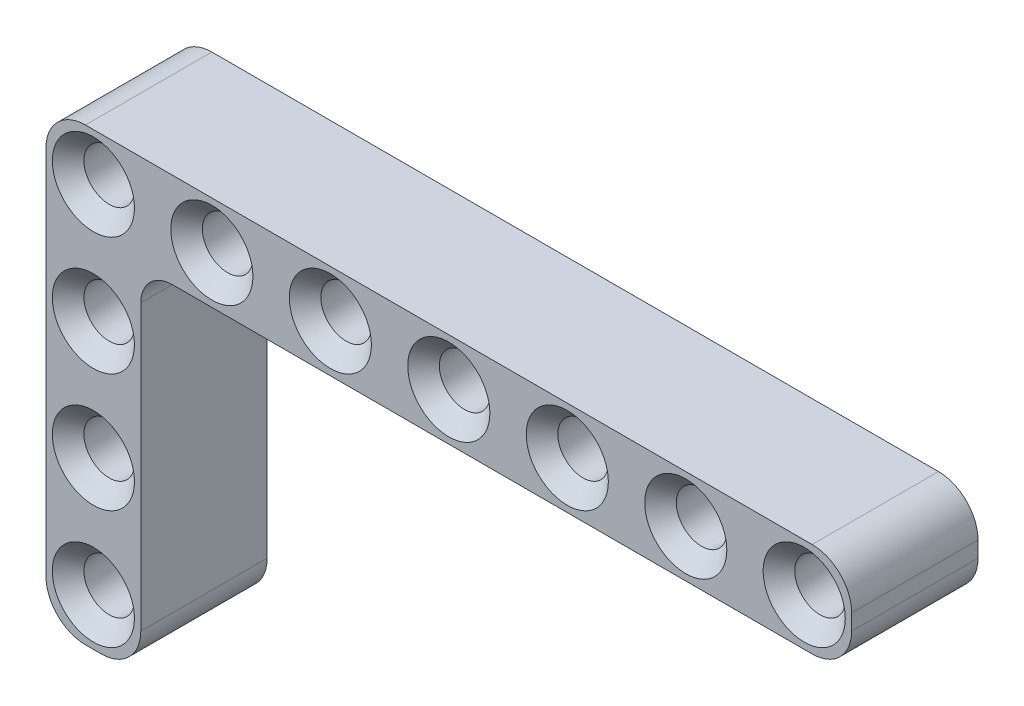
ISO-10303-21;
HEADER;
FILE_DESCRIPTION(('STEP AP214'),'2;1');
FILE_NAME('part.step','',(''),(''),'','','');
FILE_SCHEMA(('AUTOMOTIVE_DESIGN { 1 0 10303 214 1 1 1 1 }'));
ENDSEC;
DATA;
#1=APPLICATION_CONTEXT('core data for automotive mechanical design processes');
#2=APPLICATION_PROTOCOL_DEFINITION('international standard','automotive_design',2000,#1);
#3=PRODUCT_CONTEXT('',#1,'mechanical');
#4=PRODUCT('Part','Part','',(#3));
#5=PRODUCT_RELATED_PRODUCT_CATEGORY('part','',(#4));
#6=PRODUCT_DEFINITION_FORMATION('','',#4);
#7=PRODUCT_DEFINITION_CONTEXT('part definition',#1,'design');
#8=PRODUCT_DEFINITION('design','',#6,#7);
#9=PRODUCT_DEFINITION_SHAPE('','',#8);
#10=(LENGTH_UNIT() NAMED_UNIT(*) SI_UNIT(.MILLI.,.METRE.));
#11=(NAMED_UNIT(*) PLANE_ANGLE_UNIT() SI_UNIT($,.RADIAN.));
#12=(NAMED_UNIT(*) SI_UNIT($,.STERADIAN.) SOLID_ANGLE_UNIT());
#13=UNCERTAINTY_MEASURE_WITH_UNIT(LENGTH_MEASURE(1.E-05),#10,'distance_accuracy_value','');
#14=(GEOMETRIC_REPRESENTATION_CONTEXT(3) GLOBAL_UNCERTAINTY_ASSIGNED_CONTEXT((#13)) GLOBAL_UNIT_ASSIGNED_CONTEXT((#10,
#11,#12)) REPRESENTATION_CONTEXT('',''));
#15=CARTESIAN_POINT('',(0.,0.,0.));
#16=DIRECTION('',(0.,0.,1.));
#17=DIRECTION('',(1.,0.,0.));
#18=AXIS2_PLACEMENT_3D('',#15,#16,#17);
#19=CARTESIAN_POINT('',(45.5,-0.5,8.));
#20=DIRECTION('',(0.,0.,1.));
#21=DIRECTION('',(1.,0.,0.));
#22=AXIS2_PLACEMENT_3D('',#19,#20,#21);
#23=PLANE('',#22);
#24=CARTESIAN_POINT('',(0.,-7.5,8.));
#25=DIRECTION('',(0.,0.,1.));
#26=DIRECTION('',(1.,0.,0.));
#27=AXIS2_PLACEMENT_3D('',#24,#25,#26);
#28=CIRCLE('',#27,2.6);
#29=CARTESIAN_POINT('',(2.60000000000003,-7.5,8.));
#30=VERTEX_POINT('',#29);
#31=EDGE_CURVE('E318',#30,#30,#28,.F.);
#32=ORIENTED_EDGE('',*,*,#31,.T.);
#33=EDGE_LOOP('',(#32));
#34=FACE_BOUND('',#33,.T.);
#35=CARTESIAN_POINT('',(1.10050857315969E-13,-15.,8.));
#36=DIRECTION('',(0.,0.,1.));
#37=DIRECTION('',(1.,0.,0.));
#38=AXIS2_PLACEMENT_3D('',#35,#36,#37);
#39=CIRCLE('',#38,2.60000000000002);
#40=CARTESIAN_POINT('',(2.60000000000013,-15.,8.));
#41=VERTEX_POINT('',#40);
#42=EDGE_CURVE('E315',#41,#41,#39,.F.);
#43=ORIENTED_EDGE('',*,*,#42,.T.);
#44=EDGE_LOOP('',(#43));
#45=FACE_BOUND('',#44,.T.);
#46=CARTESIAN_POINT('',(1.88609187439939E-13,-22.5,8.));
#47=DIRECTION('',(0.,0.,1.));
#48=DIRECTION('',(1.,0.,0.));
#49=AXIS2_PLACEMENT_3D('',#46,#47,#48);
#50=CIRCLE('',#49,2.6);
#51=CARTESIAN_POINT('',(2.60000000000019,-22.5,8.));
#52=VERTEX_POINT('',#51);
#53=EDGE_CURVE('E312',#52,#52,#50,.F.);
#54=ORIENTED_EDGE('',*,*,#53,.T.);
#55=EDGE_LOOP('',(#54));
#56=FACE_BOUND('',#55,.T.);
#57=CARTESIAN_POINT('',(45.,0.,8.));
#58=DIRECTION('',(0.,0.,1.));
#59=DIRECTION('',(1.,0.,0.));
#60=AXIS2_PLACEMENT_3D('',#57,#58,#59);
#61=CIRCLE('',#60,2.60000000000001);
#62=CARTESIAN_POINT('',(47.6,0.,8.));
#63=VERTEX_POINT('',#62);
#64=EDGE_CURVE('E297',#63,#63,#61,.F.);
#65=ORIENTED_EDGE('',*,*,#64,.T.);
#66=EDGE_LOOP('',(#65));
#67=FACE_BOUND('',#66,.T.);
#68=CARTESIAN_POINT('',(37.5,0.,8.));
#69=DIRECTION('',(0.,0.,1.));
#70=DIRECTION('',(1.,0.,0.));
#71=AXIS2_PLACEMENT_3D('',#68,#69,#70);
#72=CIRCLE('',#71,2.60000000000001);
#73=CARTESIAN_POINT('',(40.1,0.,8.));
#74=VERTEX_POINT('',#73);
#75=EDGE_CURVE('E294',#74,#74,#72,.F.);
#76=ORIENTED_EDGE('',*,*,#75,.T.);
#77=EDGE_LOOP('',(#76));
#78=FACE_BOUND('',#77,.T.);
#79=CARTESIAN_POINT('',(30.,0.,8.));
#80=DIRECTION('',(0.,0.,1.));
#81=DIRECTION('',(1.,0.,0.));
#82=AXIS2_PLACEMENT_3D('',#79,#80,#81);
#83=CIRCLE('',#82,2.6);
#84=CARTESIAN_POINT('',(32.6,0.,8.));
#85=VERTEX_POINT('',#84);
#86=EDGE_CURVE('E248',#85,#85,#83,.F.);
#87=ORIENTED_EDGE('',*,*,#86,.T.);
#88=EDGE_LOOP('',(#87));
#89=FACE_BOUND('',#88,.T.);
#90=CARTESIAN_POINT('',(22.5,0.,8.));
#91=DIRECTION('',(0.,0.,1.));
#92=DIRECTION('',(1.,0.,0.));
#93=AXIS2_PLACEMENT_3D('',#90,#91,#92);
#94=CIRCLE('',#93,2.6);
#95=CARTESIAN_POINT('',(25.1,0.,8.));
#96=VERTEX_POINT('',#95);
#97=EDGE_CURVE('E245',#96,#96,#94,.F.);
#98=ORIENTED_EDGE('',*,*,#97,.T.);
#99=EDGE_LOOP('',(#98));
#100=FACE_BOUND('',#99,.T.);
#101=CARTESIAN_POINT('',(15.,0.,8.));
#102=DIRECTION('',(0.,0.,1.));
#103=DIRECTION('',(1.,0.,0.));
#104=AXIS2_PLACEMENT_3D('',#101,#102,#103);
#105=CIRCLE('',#104,2.6);
#106=CARTESIAN_POINT('',(17.6,0.,8.));
#107=VERTEX_POINT('',#106);
#108=EDGE_CURVE('E242',#107,#107,#105,.F.);
#109=ORIENTED_EDGE('',*,*,#108,.T.);
#110=EDGE_LOOP('',(#109));
#111=FACE_BOUND('',#110,.T.);
#112=CARTESIAN_POINT('',(7.5,0.,8.));
#113=DIRECTION('',(0.,0.,1.));
#114=DIRECTION('',(1.,0.,0.));
#115=AXIS2_PLACEMENT_3D('',#112,#113,#114);
#116=CIRCLE('',#115,2.60000000000001);
#117=CARTESIAN_POINT('',(10.1,0.,8.));
#118=VERTEX_POINT('',#117);
#119=EDGE_CURVE('E239',#118,#118,#116,.F.);
#120=ORIENTED_EDGE('',*,*,#119,.T.);
#121=EDGE_LOOP('',(#120));
#122=FACE_BOUND('',#121,.T.);
#123=CARTESIAN_POINT('',(0.,0.,8.));
#124=DIRECTION('',(0.,0.,1.));
#125=DIRECTION('',(1.,0.,0.));
#126=AXIS2_PLACEMENT_3D('',#123,#124,#125);
#127=CIRCLE('',#126,2.60000000000001);
#128=CARTESIAN_POINT('',(2.60000000000001,0.,8.));
#129=VERTEX_POINT('',#128);
#130=EDGE_CURVE('E236',#129,#129,#127,.F.);
#131=ORIENTED_EDGE('',*,*,#130,.T.);
#132=EDGE_LOOP('',(#131));
#133=FACE_BOUND('',#132,.T.);
#134=CARTESIAN_POINT('',(45.5,-0.5,8.));
#135=DIRECTION('',(0.,0.,1.));
#136=DIRECTION('',(1.,0.,0.));
#137=AXIS2_PLACEMENT_3D('',#134,#135,#136);
#138=CIRCLE('',#137,2.5);
#139=CARTESIAN_POINT('',(45.5,-3.,8.));
#140=VERTEX_POINT('',#139);
#141=CARTESIAN_POINT('',(48.,-0.5,8.));
#142=VERTEX_POINT('',#141);
#143=EDGE_CURVE('E168',#140,#142,#138,.T.);
#144=ORIENTED_EDGE('',*,*,#143,.T.);
#145=DIRECTION('',(0.,1.,0.));
#146=VECTOR('',#145,1.);
#147=CARTESIAN_POINT('',(48.,0.5,8.));
#148=LINE('',#147,#146);
#149=CARTESIAN_POINT('',(48.,0.5,8.));
#150=VERTEX_POINT('',#149);
#151=EDGE_CURVE('E171',#142,#150,#148,.T.);
#152=ORIENTED_EDGE('',*,*,#151,.T.);
#153=CARTESIAN_POINT('',(45.5,0.5,8.));
#154=DIRECTION('',(0.,0.,1.));
#155=DIRECTION('',(-1.,0.,0.));
#156=AXIS2_PLACEMENT_3D('',#153,#154,#155);
#157=CIRCLE('',#156,2.5);
#158=CARTESIAN_POINT('',(45.5,3.,8.));
#159=VERTEX_POINT('',#158);
#160=EDGE_CURVE('E174',#150,#159,#157,.T.);
#161=ORIENTED_EDGE('',*,*,#160,.T.);
#162=DIRECTION('',(-1.,0.,0.));
#163=VECTOR('',#162,1.);
#164=CARTESIAN_POINT('',(-0.5,3.,8.));
#165=LINE('',#164,#163);
#166=CARTESIAN_POINT('',(-0.5,3.,8.));
#167=VERTEX_POINT('',#166);
#168=EDGE_CURVE('E176',#159,#167,#165,.T.);
#169=ORIENTED_EDGE('',*,*,#168,.T.);
#170=CARTESIAN_POINT('',(-0.5,0.5,8.));
#171=DIRECTION('',(0.,0.,1.));
#172=DIRECTION('',(1.,0.,0.));
#173=AXIS2_PLACEMENT_3D('',#170,#171,#172);
#174=CIRCLE('',#173,2.5);
#175=CARTESIAN_POINT('',(-3.,0.5,8.));
#176=VERTEX_POINT('',#175);
#177=EDGE_CURVE('E178',#167,#176,#174,.T.);
#178=ORIENTED_EDGE('',*,*,#177,.T.);
#179=DIRECTION('',(0.,-1.,0.));
#180=VECTOR('',#179,1.);
#181=CARTESIAN_POINT('',(-3.,0.5,8.));
#182=LINE('',#181,#180);
#183=CARTESIAN_POINT('',(-2.99999999999991,-23.,8.));
#184=VERTEX_POINT('',#183);
#185=EDGE_CURVE('E180',#176,#184,#182,.T.);
#186=ORIENTED_EDGE('',*,*,#185,.T.);
#187=CARTESIAN_POINT('',(-0.499999999999911,-23.,8.));
#188=DIRECTION('',(0.,0.,1.));
#189=DIRECTION('',(1.,0.,0.));
#190=AXIS2_PLACEMENT_3D('',#187,#188,#189);
#191=CIRCLE('',#190,2.5);
#192=CARTESIAN_POINT('',(-0.499999999999901,-25.5,8.));
#193=VERTEX_POINT('',#192);
#194=EDGE_CURVE('E150',#184,#193,#191,.T.);
#195=ORIENTED_EDGE('',*,*,#194,.T.);
#196=DIRECTION('',(1.,0.,0.));
#197=VECTOR('',#196,1.);
#198=CARTESIAN_POINT('',(1.76941794549634E-13,-25.5,8.));
#199=LINE('',#198,#197);
#200=CARTESIAN_POINT('',(0.500000000000099,-25.5,8.));
#201=VERTEX_POINT('',#200);
#202=EDGE_CURVE('E158',#193,#201,#199,.T.);
#203=ORIENTED_EDGE('',*,*,#202,.T.);
#204=CARTESIAN_POINT('',(0.50000000000009,-23.,8.));
#205=DIRECTION('',(0.,0.,1.));
#206=DIRECTION('',(1.,0.,0.));
#207=AXIS2_PLACEMENT_3D('',#204,#205,#206);
#208=CIRCLE('',#207,2.5);
#209=CARTESIAN_POINT('',(3.00000000000009,-23.,8.));
#210=VERTEX_POINT('',#209);
#211=EDGE_CURVE('E129',#201,#210,#208,.T.);
#212=ORIENTED_EDGE('',*,*,#211,.T.);
#213=DIRECTION('',(0.,1.,0.));
#214=VECTOR('',#213,1.);
#215=CARTESIAN_POINT('',(3.,0.,8.));
#216=LINE('',#215,#214);
#217=CARTESIAN_POINT('',(3.00000000000002,-5.00000000000001,8.));
#218=VERTEX_POINT('',#217);
#219=EDGE_CURVE('E153',#210,#218,#216,.T.);
#220=ORIENTED_EDGE('',*,*,#219,.T.);
#221=CARTESIAN_POINT('',(5.00000000000002,-5.,8.));
#222=DIRECTION('',(0.,0.,1.));
#223=DIRECTION('',(1.,0.,0.));
#224=AXIS2_PLACEMENT_3D('',#221,#222,#223);
#225=CIRCLE('',#224,2.);
#226=CARTESIAN_POINT('',(5.00000000000002,-3.,8.));
#227=VERTEX_POINT('',#226);
#228=EDGE_CURVE('E58',#218,#227,#225,.F.);
#229=ORIENTED_EDGE('',*,*,#228,.T.);
#230=DIRECTION('',(1.,0.,0.));
#231=VECTOR('',#230,1.);
#232=CARTESIAN_POINT('',(-0.5,-3.,8.));
#233=LINE('',#232,#231);
#234=EDGE_CURVE('E182',#227,#140,#233,.T.);
#235=ORIENTED_EDGE('',*,*,#234,.T.);
#236=EDGE_LOOP('',(#144,#152,#161,#169,#178,#186,#195,#203,#212,#220,#229,#235));
#237=FACE_BOUND('',#236,.T.);
#238=ADVANCED_FACE('F35',(#34,#45,#56,#67,#78,#89,#100,#111,#122,#133,#237),#23,.T.);
#239=CARTESIAN_POINT('',(45.5,-0.5,0.));
#240=DIRECTION('',(0.,0.,1.));
#241=DIRECTION('',(1.,0.,0.));
#242=AXIS2_PLACEMENT_3D('',#239,#240,#241);
#243=PLANE('',#242);
#244=CARTESIAN_POINT('',(0.,-7.5,0.));
#245=DIRECTION('',(0.,0.,1.));
#246=DIRECTION('',(1.,0.,0.));
#247=AXIS2_PLACEMENT_3D('',#244,#245,#246);
#248=CIRCLE('',#247,2.6);
#249=CARTESIAN_POINT('',(2.60000000000004,-7.5,0.));
#250=VERTEX_POINT('',#249);
#251=EDGE_CURVE('E327',#250,#250,#248,.T.);
#252=ORIENTED_EDGE('',*,*,#251,.T.);
#253=EDGE_LOOP('',(#252));
#254=FACE_BOUND('',#253,.T.);
#255=CARTESIAN_POINT('',(1.10050857315969E-13,-15.,0.));
#256=DIRECTION('',(0.,0.,1.));
#257=DIRECTION('',(1.,0.,0.));
#258=AXIS2_PLACEMENT_3D('',#255,#256,#257);
#259=CIRCLE('',#258,2.6);
#260=CARTESIAN_POINT('',(2.60000000000011,-15.,0.));
#261=VERTEX_POINT('',#260);
#262=EDGE_CURVE('E324',#261,#261,#259,.T.);
#263=ORIENTED_EDGE('',*,*,#262,.T.);
#264=EDGE_LOOP('',(#263));
#265=FACE_BOUND('',#264,.T.);
#266=CARTESIAN_POINT('',(1.88609187439939E-13,-22.5,0.));
#267=DIRECTION('',(0.,0.,1.));
#268=DIRECTION('',(1.,0.,0.));
#269=AXIS2_PLACEMENT_3D('',#266,#267,#268);
#270=CIRCLE('',#269,2.6);
#271=CARTESIAN_POINT('',(2.60000000000019,-22.5,0.));
#272=VERTEX_POINT('',#271);
#273=EDGE_CURVE('E321',#272,#272,#270,.T.);
#274=ORIENTED_EDGE('',*,*,#273,.T.);
#275=EDGE_LOOP('',(#274));
#276=FACE_BOUND('',#275,.T.);
#277=CARTESIAN_POINT('',(45.,0.,0.));
#278=DIRECTION('',(0.,0.,1.));
#279=DIRECTION('',(1.,0.,0.));
#280=AXIS2_PLACEMENT_3D('',#277,#278,#279);
#281=CIRCLE('',#280,2.6);
#282=CARTESIAN_POINT('',(47.6,0.,0.));
#283=VERTEX_POINT('',#282);
#284=EDGE_CURVE('E285',#283,#283,#281,.T.);
#285=ORIENTED_EDGE('',*,*,#284,.T.);
#286=EDGE_LOOP('',(#285));
#287=FACE_BOUND('',#286,.T.);
#288=CARTESIAN_POINT('',(37.5,0.,0.));
#289=DIRECTION('',(0.,0.,1.));
#290=DIRECTION('',(1.,0.,0.));
#291=AXIS2_PLACEMENT_3D('',#288,#289,#290);
#292=CIRCLE('',#291,2.59999999999998);
#293=CARTESIAN_POINT('',(40.1,0.,0.));
#294=VERTEX_POINT('',#293);
#295=EDGE_CURVE('E282',#294,#294,#292,.T.);
#296=ORIENTED_EDGE('',*,*,#295,.T.);
#297=EDGE_LOOP('',(#296));
#298=FACE_BOUND('',#297,.T.);
#299=CARTESIAN_POINT('',(30.,0.,0.));
#300=DIRECTION('',(0.,0.,1.));
#301=DIRECTION('',(1.,0.,0.));
#302=AXIS2_PLACEMENT_3D('',#299,#300,#301);
#303=CIRCLE('',#302,2.6);
#304=CARTESIAN_POINT('',(32.6,0.,0.));
#305=VERTEX_POINT('',#304);
#306=EDGE_CURVE('E227',#305,#305,#303,.T.);
#307=ORIENTED_EDGE('',*,*,#306,.T.);
#308=EDGE_LOOP('',(#307));
#309=FACE_BOUND('',#308,.T.);
#310=CARTESIAN_POINT('',(22.5,0.,0.));
#311=DIRECTION('',(0.,0.,1.));
#312=DIRECTION('',(1.,0.,0.));
#313=AXIS2_PLACEMENT_3D('',#310,#311,#312);
#314=CIRCLE('',#313,2.6);
#315=CARTESIAN_POINT('',(25.1,0.,0.));
#316=VERTEX_POINT('',#315);
#317=EDGE_CURVE('E224',#316,#316,#314,.T.);
#318=ORIENTED_EDGE('',*,*,#317,.T.);
#319=EDGE_LOOP('',(#318));
#320=FACE_BOUND('',#319,.T.);
#321=CARTESIAN_POINT('',(15.,0.,0.));
#322=DIRECTION('',(0.,0.,1.));
#323=DIRECTION('',(1.,0.,0.));
#324=AXIS2_PLACEMENT_3D('',#321,#322,#323);
#325=CIRCLE('',#324,2.6);
#326=CARTESIAN_POINT('',(17.6,0.,0.));
#327=VERTEX_POINT('',#326);
#328=EDGE_CURVE('E221',#327,#327,#325,.T.);
#329=ORIENTED_EDGE('',*,*,#328,.T.);
#330=EDGE_LOOP('',(#329));
#331=FACE_BOUND('',#330,.T.);
#332=CARTESIAN_POINT('',(7.5,0.,0.));
#333=DIRECTION('',(0.,0.,1.));
#334=DIRECTION('',(1.,0.,0.));
#335=AXIS2_PLACEMENT_3D('',#332,#333,#334);
#336=CIRCLE('',#335,2.59999999999999);
#337=CARTESIAN_POINT('',(10.1,0.,0.));
#338=VERTEX_POINT('',#337);
#339=EDGE_CURVE('E218',#338,#338,#336,.T.);
#340=ORIENTED_EDGE('',*,*,#339,.T.);
#341=EDGE_LOOP('',(#340));
#342=FACE_BOUND('',#341,.T.);
#343=CARTESIAN_POINT('',(0.,0.,0.));
#344=DIRECTION('',(0.,0.,1.));
#345=DIRECTION('',(1.,0.,0.));
#346=AXIS2_PLACEMENT_3D('',#343,#344,#345);
#347=CIRCLE('',#346,2.59999999999999);
#348=CARTESIAN_POINT('',(2.59999999999999,0.,0.));
#349=VERTEX_POINT('',#348);
#350=EDGE_CURVE('E215',#349,#349,#347,.T.);
#351=ORIENTED_EDGE('',*,*,#350,.T.);
#352=EDGE_LOOP('',(#351));
#353=FACE_BOUND('',#352,.T.);
#354=CARTESIAN_POINT('',(45.5,-0.5,0.));
#355=DIRECTION('',(0.,0.,1.));
#356=DIRECTION('',(1.,0.,0.));
#357=AXIS2_PLACEMENT_3D('',#354,#355,#356);
#358=CIRCLE('',#357,2.5);
#359=CARTESIAN_POINT('',(45.5,-3.,0.));
#360=VERTEX_POINT('',#359);
#361=CARTESIAN_POINT('',(48.,-0.5,0.));
#362=VERTEX_POINT('',#361);
#363=EDGE_CURVE('E163',#360,#362,#358,.T.);
#364=ORIENTED_EDGE('',*,*,#363,.F.);
#365=DIRECTION('',(1.,0.,0.));
#366=VECTOR('',#365,1.);
#367=CARTESIAN_POINT('',(-0.5,-3.,0.));
#368=LINE('',#367,#366);
#369=CARTESIAN_POINT('',(5.00000000000002,-3.,0.));
#370=VERTEX_POINT('',#369);
#371=EDGE_CURVE('E172',#370,#360,#368,.T.);
#372=ORIENTED_EDGE('',*,*,#371,.F.);
#373=CARTESIAN_POINT('',(5.00000000000002,-5.,0.));
#374=DIRECTION('',(0.,0.,1.));
#375=DIRECTION('',(1.,0.,0.));
#376=AXIS2_PLACEMENT_3D('',#373,#374,#375);
#377=CIRCLE('',#376,2.);
#378=CARTESIAN_POINT('',(3.00000000000002,-5.00000000000001,0.));
#379=VERTEX_POINT('',#378);
#380=EDGE_CURVE('E280',#370,#379,#377,.T.);
#381=ORIENTED_EDGE('',*,*,#380,.T.);
#382=DIRECTION('',(0.,1.,0.));
#383=VECTOR('',#382,1.);
#384=CARTESIAN_POINT('',(3.,0.,0.));
#385=LINE('',#384,#383);
#386=CARTESIAN_POINT('',(3.00000000000009,-23.,0.));
#387=VERTEX_POINT('',#386);
#388=EDGE_CURVE('E146',#387,#379,#385,.T.);
#389=ORIENTED_EDGE('',*,*,#388,.F.);
#390=CARTESIAN_POINT('',(0.50000000000009,-23.,0.));
#391=DIRECTION('',(0.,0.,1.));
#392=DIRECTION('',(1.,0.,0.));
#393=AXIS2_PLACEMENT_3D('',#390,#391,#392);
#394=CIRCLE('',#393,2.5);
#395=CARTESIAN_POINT('',(0.500000000000099,-25.5,0.));
#396=VERTEX_POINT('',#395);
#397=EDGE_CURVE('E127',#396,#387,#394,.T.);
#398=ORIENTED_EDGE('',*,*,#397,.F.);
#399=DIRECTION('',(1.,0.,0.));
#400=VECTOR('',#399,1.);
#401=CARTESIAN_POINT('',(1.76941794549634E-13,-25.5,0.));
#402=LINE('',#401,#400);
#403=CARTESIAN_POINT('',(-0.499999999999901,-25.5,0.));
#404=VERTEX_POINT('',#403);
#405=EDGE_CURVE('E143',#404,#396,#402,.T.);
#406=ORIENTED_EDGE('',*,*,#405,.F.);
#407=CARTESIAN_POINT('',(-0.499999999999911,-23.,0.));
#408=DIRECTION('',(0.,0.,1.));
#409=DIRECTION('',(1.,0.,0.));
#410=AXIS2_PLACEMENT_3D('',#407,#408,#409);
#411=CIRCLE('',#410,2.5);
#412=CARTESIAN_POINT('',(-2.99999999999991,-23.,0.));
#413=VERTEX_POINT('',#412);
#414=EDGE_CURVE('E135',#413,#404,#411,.T.);
#415=ORIENTED_EDGE('',*,*,#414,.F.);
#416=DIRECTION('',(0.,-1.,0.));
#417=VECTOR('',#416,1.);
#418=CARTESIAN_POINT('',(-3.,0.5,0.));
#419=LINE('',#418,#417);
#420=CARTESIAN_POINT('',(-3.,0.5,0.));
#421=VERTEX_POINT('',#420);
#422=EDGE_CURVE('E195',#421,#413,#419,.T.);
#423=ORIENTED_EDGE('',*,*,#422,.F.);
#424=CARTESIAN_POINT('',(-0.5,0.5,0.));
#425=DIRECTION('',(0.,0.,1.));
#426=DIRECTION('',(1.,0.,0.));
#427=AXIS2_PLACEMENT_3D('',#424,#425,#426);
#428=CIRCLE('',#427,2.5);
#429=CARTESIAN_POINT('',(-0.5,3.,0.));
#430=VERTEX_POINT('',#429);
#431=EDGE_CURVE('E193',#430,#421,#428,.T.);
#432=ORIENTED_EDGE('',*,*,#431,.F.);
#433=DIRECTION('',(-1.,0.,0.));
#434=VECTOR('',#433,1.);
#435=CARTESIAN_POINT('',(-0.5,3.,0.));
#436=LINE('',#435,#434);
#437=CARTESIAN_POINT('',(45.5,3.,0.));
#438=VERTEX_POINT('',#437);
#439=EDGE_CURVE('E191',#438,#430,#436,.T.);
#440=ORIENTED_EDGE('',*,*,#439,.F.);
#441=CARTESIAN_POINT('',(45.5,0.5,0.));
#442=DIRECTION('',(0.,0.,1.));
#443=DIRECTION('',(-1.,0.,0.));
#444=AXIS2_PLACEMENT_3D('',#441,#442,#443);
#445=CIRCLE('',#444,2.5);
#446=CARTESIAN_POINT('',(48.,0.5,0.));
#447=VERTEX_POINT('',#446);
#448=EDGE_CURVE('E189',#447,#438,#445,.T.);
#449=ORIENTED_EDGE('',*,*,#448,.F.);
#450=DIRECTION('',(0.,1.,0.));
#451=VECTOR('',#450,1.);
#452=CARTESIAN_POINT('',(48.,0.5,0.));
#453=LINE('',#452,#451);
#454=EDGE_CURVE('E187',#362,#447,#453,.T.);
#455=ORIENTED_EDGE('',*,*,#454,.F.);
#456=EDGE_LOOP('',(#364,#372,#381,#389,#398,#406,#415,#423,#432,#440,#449,#455));
#457=FACE_BOUND('',#456,.T.);
#458=ADVANCED_FACE('F141',(#254,#265,#276,#287,#298,#309,#320,#331,#342,#353,#457),#243,.F.);
#459=CARTESIAN_POINT('',(45.5,-0.5,8.));
#460=DIRECTION('',(0.,0.,-1.));
#461=DIRECTION('',(-1.,0.,0.));
#462=AXIS2_PLACEMENT_3D('',#459,#460,#461);
#463=CYLINDRICAL_SURFACE('',#462,2.5);
#464=ORIENTED_EDGE('',*,*,#363,.T.);
#465=DIRECTION('',(0.,0.,-1.));
#466=VECTOR('',#465,1.);
#467=CARTESIAN_POINT('',(48.,-0.5,8.));
#468=LINE('',#467,#466);
#469=EDGE_CURVE('E212',#142,#362,#468,.T.);
#470=ORIENTED_EDGE('',*,*,#469,.F.);
#471=ORIENTED_EDGE('',*,*,#143,.F.);
#472=DIRECTION('',(0.,0.,-1.));
#473=VECTOR('',#472,1.);
#474=CARTESIAN_POINT('',(45.5,-3.,8.));
#475=LINE('',#474,#473);
#476=EDGE_CURVE('E184',#140,#360,#475,.T.);
#477=ORIENTED_EDGE('',*,*,#476,.T.);
#478=EDGE_LOOP('',(#464,#470,#471,#477));
#479=FACE_BOUND('',#478,.T.);
#480=ADVANCED_FACE('F347',(#479),#463,.T.);
#481=CARTESIAN_POINT('',(48.,0.5,8.));
#482=DIRECTION('',(-1.,0.,0.));
#483=DIRECTION('',(0.,0.,1.));
#484=AXIS2_PLACEMENT_3D('',#481,#482,#483);
#485=PLANE('',#484);
#486=ORIENTED_EDGE('',*,*,#454,.T.);
#487=DIRECTION('',(0.,0.,-1.));
#488=VECTOR('',#487,1.);
#489=CARTESIAN_POINT('',(48.,0.5,8.));
#490=LINE('',#489,#488);
#491=EDGE_CURVE('E209',#150,#447,#490,.T.);
#492=ORIENTED_EDGE('',*,*,#491,.F.);
#493=ORIENTED_EDGE('',*,*,#151,.F.);
#494=ORIENTED_EDGE('',*,*,#469,.T.);
#495=EDGE_LOOP('',(#486,#492,#493,#494));
#496=FACE_BOUND('',#495,.T.);
#497=ADVANCED_FACE('F408',(#496),#485,.F.);
#498=CARTESIAN_POINT('',(45.5,0.5,8.));
#499=DIRECTION('',(0.,0.,-1.));
#500=DIRECTION('',(-1.,0.,0.));
#501=AXIS2_PLACEMENT_3D('',#498,#499,#500);
#502=CYLINDRICAL_SURFACE('',#501,2.5);
#503=ORIENTED_EDGE('',*,*,#448,.T.);
#504=DIRECTION('',(0.,0.,-1.));
#505=VECTOR('',#504,1.);
#506=CARTESIAN_POINT('',(45.5,3.,8.));
#507=LINE('',#506,#505);
#508=EDGE_CURVE('E206',#159,#438,#507,.T.);
#509=ORIENTED_EDGE('',*,*,#508,.F.);
#510=ORIENTED_EDGE('',*,*,#160,.F.);
#511=ORIENTED_EDGE('',*,*,#491,.T.);
#512=EDGE_LOOP('',(#503,#509,#510,#511));
#513=FACE_BOUND('',#512,.T.);
#514=ADVANCED_FACE('F404',(#513),#502,.T.);
#515=CARTESIAN_POINT('',(-0.5,3.,8.));
#516=DIRECTION('',(0.,-1.,0.));
#517=DIRECTION('',(1.,0.,0.));
#518=AXIS2_PLACEMENT_3D('',#515,#516,#517);
#519=PLANE('',#518);
#520=ORIENTED_EDGE('',*,*,#439,.T.);
#521=DIRECTION('',(0.,0.,-1.));
#522=VECTOR('',#521,1.);
#523=CARTESIAN_POINT('',(-0.5,3.,8.));
#524=LINE('',#523,#522);
#525=EDGE_CURVE('E203',#167,#430,#524,.T.);
#526=ORIENTED_EDGE('',*,*,#525,.F.);
#527=ORIENTED_EDGE('',*,*,#168,.F.);
#528=ORIENTED_EDGE('',*,*,#508,.T.);
#529=EDGE_LOOP('',(#520,#526,#527,#528));
#530=FACE_BOUND('',#529,.T.);
#531=ADVANCED_FACE('F400',(#530),#519,.F.);
#532=CARTESIAN_POINT('',(-0.5,0.5,8.));
#533=DIRECTION('',(0.,0.,-1.));
#534=DIRECTION('',(-1.,0.,0.));
#535=AXIS2_PLACEMENT_3D('',#532,#533,#534);
#536=CYLINDRICAL_SURFACE('',#535,2.5);
#537=ORIENTED_EDGE('',*,*,#431,.T.);
#538=DIRECTION('',(0.,0.,-1.));
#539=VECTOR('',#538,1.);
#540=CARTESIAN_POINT('',(-3.,0.5,8.));
#541=LINE('',#540,#539);
#542=EDGE_CURVE('E200',#176,#421,#541,.T.);
#543=ORIENTED_EDGE('',*,*,#542,.F.);
#544=ORIENTED_EDGE('',*,*,#177,.F.);
#545=ORIENTED_EDGE('',*,*,#525,.T.);
#546=EDGE_LOOP('',(#537,#543,#544,#545));
#547=FACE_BOUND('',#546,.T.);
#548=ADVANCED_FACE('F396',(#547),#536,.T.);
#549=CARTESIAN_POINT('',(-3.,0.5,8.));
#550=DIRECTION('',(1.,0.,0.));
#551=DIRECTION('',(0.,0.,-1.));
#552=AXIS2_PLACEMENT_3D('',#549,#550,#551);
#553=PLANE('',#552);
#554=ORIENTED_EDGE('',*,*,#422,.T.);
#555=DIRECTION('',(0.,0.,1.));
#556=VECTOR('',#555,1.);
#557=CARTESIAN_POINT('',(-2.99999999999991,-23.,0.));
#558=LINE('',#557,#556);
#559=EDGE_CURVE('E164',#413,#184,#558,.T.);
#560=ORIENTED_EDGE('',*,*,#559,.T.);
#561=ORIENTED_EDGE('',*,*,#185,.F.);
#562=ORIENTED_EDGE('',*,*,#542,.T.);
#563=EDGE_LOOP('',(#554,#560,#561,#562));
#564=FACE_BOUND('',#563,.T.);
#565=ADVANCED_FACE('F393',(#564),#553,.F.);
#566=CARTESIAN_POINT('',(-0.5,-3.,8.));
#567=DIRECTION('',(0.,1.,0.));
#568=DIRECTION('',(-1.,0.,0.));
#569=AXIS2_PLACEMENT_3D('',#566,#567,#568);
#570=PLANE('',#569);
#571=ORIENTED_EDGE('',*,*,#234,.F.);
#572=DIRECTION('',(0.,0.,1.));
#573=VECTOR('',#572,1.);
#574=CARTESIAN_POINT('',(5.00000000000002,-3.,8.));
#575=LINE('',#574,#573);
#576=EDGE_CURVE('E50',#227,#370,#575,.F.);
#577=ORIENTED_EDGE('',*,*,#576,.T.);
#578=ORIENTED_EDGE('',*,*,#371,.T.);
#579=ORIENTED_EDGE('',*,*,#476,.F.);
#580=EDGE_LOOP('',(#571,#577,#578,#579));
#581=FACE_BOUND('',#580,.T.);
#582=ADVANCED_FACE('F390',(#581),#570,.F.);
#583=CARTESIAN_POINT('',(0.,0.,8.));
#584=DIRECTION('',(0.,0.,-1.));
#585=DIRECTION('',(-1.,0.,0.));
#586=AXIS2_PLACEMENT_3D('',#583,#584,#585);
#587=CYLINDRICAL_SURFACE('',#586,1.6);
#588=CARTESIAN_POINT('',(0.,0.,0.999999999999992));
#589=DIRECTION('',(0.,0.,1.));
#590=DIRECTION('',(1.,0.,0.));
#591=AXIS2_PLACEMENT_3D('',#588,#589,#590);
#592=CIRCLE('',#591,1.6);
#593=CARTESIAN_POINT('',(1.6,0.,0.999999999999992));
#594=VERTEX_POINT('',#593);
#595=EDGE_CURVE('E272',#594,#594,#592,.F.);
#596=ORIENTED_EDGE('',*,*,#595,.T.);
#597=EDGE_LOOP('',(#596));
#598=FACE_BOUND('',#597,.T.);
#599=CARTESIAN_POINT('',(0.,0.,7.));
#600=DIRECTION('',(0.,0.,1.));
#601=DIRECTION('',(1.,0.,0.));
#602=AXIS2_PLACEMENT_3D('',#599,#600,#601);
#603=CIRCLE('',#602,1.6);
#604=CARTESIAN_POINT('',(1.6,0.,7.));
#605=VERTEX_POINT('',#604);
#606=EDGE_CURVE('E269',#605,#605,#603,.T.);
#607=ORIENTED_EDGE('',*,*,#606,.T.);
#608=EDGE_LOOP('',(#607));
#609=FACE_BOUND('',#608,.T.);
#610=ADVANCED_FACE('F387',(#598,#609),#587,.F.);
#611=CARTESIAN_POINT('',(7.5,0.,8.));
#612=DIRECTION('',(0.,0.,-1.));
#613=DIRECTION('',(-1.,0.,0.));
#614=AXIS2_PLACEMENT_3D('',#611,#612,#613);
#615=CYLINDRICAL_SURFACE('',#614,1.6);
#616=CARTESIAN_POINT('',(7.5,0.,0.99999999999999));
#617=DIRECTION('',(0.,0.,1.));
#618=DIRECTION('',(1.,0.,0.));
#619=AXIS2_PLACEMENT_3D('',#616,#617,#618);
#620=CIRCLE('',#619,1.6);
#621=CARTESIAN_POINT('',(9.1,0.,0.99999999999999));
#622=VERTEX_POINT('',#621);
#623=EDGE_CURVE('E266',#622,#622,#620,.F.);
#624=ORIENTED_EDGE('',*,*,#623,.T.);
#625=EDGE_LOOP('',(#624));
#626=FACE_BOUND('',#625,.T.);
#627=CARTESIAN_POINT('',(7.5,0.,7.));
#628=DIRECTION('',(0.,0.,1.));
#629=DIRECTION('',(1.,0.,0.));
#630=AXIS2_PLACEMENT_3D('',#627,#628,#629);
#631=CIRCLE('',#630,1.6);
#632=CARTESIAN_POINT('',(9.1,0.,7.));
#633=VERTEX_POINT('',#632);
#634=EDGE_CURVE('E263',#633,#633,#631,.T.);
#635=ORIENTED_EDGE('',*,*,#634,.T.);
#636=EDGE_LOOP('',(#635));
#637=FACE_BOUND('',#636,.T.);
#638=ADVANCED_FACE('F448',(#626,#637),#615,.F.);
#639=CARTESIAN_POINT('',(15.,0.,8.));
#640=DIRECTION('',(0.,0.,-1.));
#641=DIRECTION('',(-1.,0.,0.));
#642=AXIS2_PLACEMENT_3D('',#639,#640,#641);
#643=CYLINDRICAL_SURFACE('',#642,1.6);
#644=CARTESIAN_POINT('',(15.,0.,1.00000000000001));
#645=DIRECTION('',(0.,0.,1.));
#646=DIRECTION('',(1.,0.,0.));
#647=AXIS2_PLACEMENT_3D('',#644,#645,#646);
#648=CIRCLE('',#647,1.6);
#649=CARTESIAN_POINT('',(16.6,0.,1.00000000000001));
#650=VERTEX_POINT('',#649);
#651=EDGE_CURVE('E260',#650,#650,#648,.F.);
#652=ORIENTED_EDGE('',*,*,#651,.T.);
#653=EDGE_LOOP('',(#652));
#654=FACE_BOUND('',#653,.T.);
#655=CARTESIAN_POINT('',(15.,0.,7.));
#656=DIRECTION('',(0.,0.,1.));
#657=DIRECTION('',(1.,0.,0.));
#658=AXIS2_PLACEMENT_3D('',#655,#656,#657);
#659=CIRCLE('',#658,1.6);
#660=CARTESIAN_POINT('',(16.6,0.,7.));
#661=VERTEX_POINT('',#660);
#662=EDGE_CURVE('E257',#661,#661,#659,.T.);
#663=ORIENTED_EDGE('',*,*,#662,.T.);
#664=EDGE_LOOP('',(#663));
#665=FACE_BOUND('',#664,.T.);
#666=ADVANCED_FACE('F451',(#654,#665),#643,.F.);
#667=CARTESIAN_POINT('',(22.5,0.,8.));
#668=DIRECTION('',(0.,0.,-1.));
#669=DIRECTION('',(-1.,0.,0.));
#670=AXIS2_PLACEMENT_3D('',#667,#668,#669);
#671=CYLINDRICAL_SURFACE('',#670,1.6);
#672=CARTESIAN_POINT('',(22.5,0.,1.00000000000001));
#673=DIRECTION('',(0.,0.,1.));
#674=DIRECTION('',(1.,0.,0.));
#675=AXIS2_PLACEMENT_3D('',#672,#673,#674);
#676=CIRCLE('',#675,1.6);
#677=CARTESIAN_POINT('',(24.1,0.,1.00000000000001));
#678=VERTEX_POINT('',#677);
#679=EDGE_CURVE('E254',#678,#678,#676,.F.);
#680=ORIENTED_EDGE('',*,*,#679,.T.);
#681=EDGE_LOOP('',(#680));
#682=FACE_BOUND('',#681,.T.);
#683=CARTESIAN_POINT('',(22.5,0.,7.));
#684=DIRECTION('',(0.,0.,1.));
#685=DIRECTION('',(1.,0.,0.));
#686=AXIS2_PLACEMENT_3D('',#683,#684,#685);
#687=CIRCLE('',#686,1.6);
#688=CARTESIAN_POINT('',(24.1,0.,7.));
#689=VERTEX_POINT('',#688);
#690=EDGE_CURVE('E251',#689,#689,#687,.T.);
#691=ORIENTED_EDGE('',*,*,#690,.T.);
#692=EDGE_LOOP('',(#691));
#693=FACE_BOUND('',#692,.T.);
#694=ADVANCED_FACE('F458',(#682,#693),#671,.F.);
#695=CARTESIAN_POINT('',(30.,0.,8.));
#696=DIRECTION('',(0.,0.,-1.));
#697=DIRECTION('',(-1.,0.,0.));
#698=AXIS2_PLACEMENT_3D('',#695,#696,#697);
#699=CYLINDRICAL_SURFACE('',#698,1.6);
#700=CARTESIAN_POINT('',(30.,0.,1.00000000000001));
#701=DIRECTION('',(0.,0.,1.));
#702=DIRECTION('',(1.,0.,0.));
#703=AXIS2_PLACEMENT_3D('',#700,#701,#702);
#704=CIRCLE('',#703,1.6);
#705=CARTESIAN_POINT('',(31.6,0.,1.00000000000001));
#706=VERTEX_POINT('',#705);
#707=EDGE_CURVE('E233',#706,#706,#704,.F.);
#708=ORIENTED_EDGE('',*,*,#707,.T.);
#709=EDGE_LOOP('',(#708));
#710=FACE_BOUND('',#709,.T.);
#711=CARTESIAN_POINT('',(30.,0.,7.));
#712=DIRECTION('',(0.,0.,1.));
#713=DIRECTION('',(1.,0.,0.));
#714=AXIS2_PLACEMENT_3D('',#711,#712,#713);
#715=CIRCLE('',#714,1.6);
#716=CARTESIAN_POINT('',(31.6,0.,7.));
#717=VERTEX_POINT('',#716);
#718=EDGE_CURVE('E230',#717,#717,#715,.T.);
#719=ORIENTED_EDGE('',*,*,#718,.T.);
#720=EDGE_LOOP('',(#719));
#721=FACE_BOUND('',#720,.T.);
#722=ADVANCED_FACE('F465',(#710,#721),#699,.F.);
#723=CARTESIAN_POINT('',(37.5,0.,8.));
#724=DIRECTION('',(0.,0.,-1.));
#725=DIRECTION('',(-1.,0.,0.));
#726=AXIS2_PLACEMENT_3D('',#723,#724,#725);
#727=CYLINDRICAL_SURFACE('',#726,1.6);
#728=CARTESIAN_POINT('',(37.5,0.,0.999999999999997));
#729=DIRECTION('',(0.,0.,1.));
#730=DIRECTION('',(1.,0.,0.));
#731=AXIS2_PLACEMENT_3D('',#728,#729,#730);
#732=CIRCLE('',#731,1.6);
#733=CARTESIAN_POINT('',(39.1,0.,0.999999999999997));
#734=VERTEX_POINT('',#733);
#735=EDGE_CURVE('E303',#734,#734,#732,.F.);
#736=ORIENTED_EDGE('',*,*,#735,.T.);
#737=EDGE_LOOP('',(#736));
#738=FACE_BOUND('',#737,.T.);
#739=CARTESIAN_POINT('',(37.5,0.,6.99999999999999));
#740=DIRECTION('',(0.,0.,1.));
#741=DIRECTION('',(1.,0.,0.));
#742=AXIS2_PLACEMENT_3D('',#739,#740,#741);
#743=CIRCLE('',#742,1.6);
#744=CARTESIAN_POINT('',(39.1,0.,6.99999999999999));
#745=VERTEX_POINT('',#744);
#746=EDGE_CURVE('E300',#745,#745,#743,.T.);
#747=ORIENTED_EDGE('',*,*,#746,.T.);
#748=EDGE_LOOP('',(#747));
#749=FACE_BOUND('',#748,.T.);
#750=ADVANCED_FACE('F469',(#738,#749),#727,.F.);
#751=CARTESIAN_POINT('',(45.,0.,8.));
#752=DIRECTION('',(0.,0.,-1.));
#753=DIRECTION('',(-1.,0.,0.));
#754=AXIS2_PLACEMENT_3D('',#751,#752,#753);
#755=CYLINDRICAL_SURFACE('',#754,1.6);
#756=CARTESIAN_POINT('',(45.,0.,1.00000000000001));
#757=DIRECTION('',(0.,0.,1.));
#758=DIRECTION('',(1.,0.,0.));
#759=AXIS2_PLACEMENT_3D('',#756,#757,#758);
#760=CIRCLE('',#759,1.6);
#761=CARTESIAN_POINT('',(46.6,0.,1.00000000000001));
#762=VERTEX_POINT('',#761);
#763=EDGE_CURVE('E291',#762,#762,#760,.F.);
#764=ORIENTED_EDGE('',*,*,#763,.T.);
#765=EDGE_LOOP('',(#764));
#766=FACE_BOUND('',#765,.T.);
#767=CARTESIAN_POINT('',(45.,0.,6.99999999999999));
#768=DIRECTION('',(0.,0.,1.));
#769=DIRECTION('',(1.,0.,0.));
#770=AXIS2_PLACEMENT_3D('',#767,#768,#769);
#771=CIRCLE('',#770,1.6);
#772=CARTESIAN_POINT('',(46.6,0.,6.99999999999999));
#773=VERTEX_POINT('',#772);
#774=EDGE_CURVE('E288',#773,#773,#771,.T.);
#775=ORIENTED_EDGE('',*,*,#774,.T.);
#776=EDGE_LOOP('',(#775));
#777=FACE_BOUND('',#776,.T.);
#778=ADVANCED_FACE('F420',(#766,#777),#755,.F.);
#779=CARTESIAN_POINT('',(30.,0.,0.));
#780=DIRECTION('',(0.,0.,-1.));
#781=DIRECTION('',(-1.,0.,0.));
#782=AXIS2_PLACEMENT_3D('',#779,#780,#781);
#783=CONICAL_SURFACE('',#782,2.6,0.785398163397444);
#784=ORIENTED_EDGE('',*,*,#707,.F.);
#785=EDGE_LOOP('',(#784));
#786=FACE_BOUND('',#785,.T.);
#787=ORIENTED_EDGE('',*,*,#306,.F.);
#788=EDGE_LOOP('',(#787));
#789=FACE_BOUND('',#788,.T.);
#790=ADVANCED_FACE('F416',(#786,#789),#783,.F.);
#791=CARTESIAN_POINT('',(30.,0.,7.));
#792=DIRECTION('',(0.,0.,1.));
#793=DIRECTION('',(1.,0.,0.));
#794=AXIS2_PLACEMENT_3D('',#791,#792,#793);
#795=CONICAL_SURFACE('',#794,1.6,0.785398163397449);
#796=ORIENTED_EDGE('',*,*,#86,.F.);
#797=EDGE_LOOP('',(#796));
#798=FACE_BOUND('',#797,.T.);
#799=ORIENTED_EDGE('',*,*,#718,.F.);
#800=EDGE_LOOP('',(#799));
#801=FACE_BOUND('',#800,.T.);
#802=ADVANCED_FACE('F419',(#798,#801),#795,.F.);
#803=CARTESIAN_POINT('',(22.5,0.,0.));
#804=DIRECTION('',(0.,0.,-1.));
#805=DIRECTION('',(-1.,0.,0.));
#806=AXIS2_PLACEMENT_3D('',#803,#804,#805);
#807=CONICAL_SURFACE('',#806,2.6,0.785398163397444);
#808=ORIENTED_EDGE('',*,*,#679,.F.);
#809=EDGE_LOOP('',(#808));
#810=FACE_BOUND('',#809,.T.);
#811=ORIENTED_EDGE('',*,*,#317,.F.);
#812=EDGE_LOOP('',(#811));
#813=FACE_BOUND('',#812,.T.);
#814=ADVANCED_FACE('F424',(#810,#813),#807,.F.);
#815=CARTESIAN_POINT('',(22.5,0.,7.));
#816=DIRECTION('',(0.,0.,1.));
#817=DIRECTION('',(1.,0.,0.));
#818=AXIS2_PLACEMENT_3D('',#815,#816,#817);
#819=CONICAL_SURFACE('',#818,1.6,0.785398163397449);
#820=ORIENTED_EDGE('',*,*,#97,.F.);
#821=EDGE_LOOP('',(#820));
#822=FACE_BOUND('',#821,.T.);
#823=ORIENTED_EDGE('',*,*,#690,.F.);
#824=EDGE_LOOP('',(#823));
#825=FACE_BOUND('',#824,.T.);
#826=ADVANCED_FACE('F428',(#822,#825),#819,.F.);
#827=CARTESIAN_POINT('',(15.,0.,0.));
#828=DIRECTION('',(0.,0.,-1.));
#829=DIRECTION('',(-1.,0.,0.));
#830=AXIS2_PLACEMENT_3D('',#827,#828,#829);
#831=CONICAL_SURFACE('',#830,2.6,0.785398163397444);
#832=ORIENTED_EDGE('',*,*,#651,.F.);
#833=EDGE_LOOP('',(#832));
#834=FACE_BOUND('',#833,.T.);
#835=ORIENTED_EDGE('',*,*,#328,.F.);
#836=EDGE_LOOP('',(#835));
#837=FACE_BOUND('',#836,.T.);
#838=ADVANCED_FACE('F432',(#834,#837),#831,.F.);
#839=CARTESIAN_POINT('',(15.,0.,7.));
#840=DIRECTION('',(0.,0.,1.));
#841=DIRECTION('',(1.,0.,0.));
#842=AXIS2_PLACEMENT_3D('',#839,#840,#841);
#843=CONICAL_SURFACE('',#842,1.6,0.785398163397449);
#844=ORIENTED_EDGE('',*,*,#108,.F.);
#845=EDGE_LOOP('',(#844));
#846=FACE_BOUND('',#845,.T.);
#847=ORIENTED_EDGE('',*,*,#662,.F.);
#848=EDGE_LOOP('',(#847));
#849=FACE_BOUND('',#848,.T.);
#850=ADVANCED_FACE('F436',(#846,#849),#843,.F.);
#851=CARTESIAN_POINT('',(7.5,0.,0.));
#852=DIRECTION('',(0.,0.,-1.));
#853=DIRECTION('',(-1.,0.,0.));
#854=AXIS2_PLACEMENT_3D('',#851,#852,#853);
#855=CONICAL_SURFACE('',#854,2.59999999999999,0.785398163397448);
#856=ORIENTED_EDGE('',*,*,#623,.F.);
#857=EDGE_LOOP('',(#856));
#858=FACE_BOUND('',#857,.T.);
#859=ORIENTED_EDGE('',*,*,#339,.F.);
#860=EDGE_LOOP('',(#859));
#861=FACE_BOUND('',#860,.T.);
#862=ADVANCED_FACE('F376',(#858,#861),#855,.F.);
#863=CARTESIAN_POINT('',(7.5,0.,7.));
#864=DIRECTION('',(0.,0.,1.));
#865=DIRECTION('',(1.,0.,0.));
#866=AXIS2_PLACEMENT_3D('',#863,#864,#865);
#867=CONICAL_SURFACE('',#866,1.6,0.785398163397452);
#868=ORIENTED_EDGE('',*,*,#119,.F.);
#869=EDGE_LOOP('',(#868));
#870=FACE_BOUND('',#869,.T.);
#871=ORIENTED_EDGE('',*,*,#634,.F.);
#872=EDGE_LOOP('',(#871));
#873=FACE_BOUND('',#872,.T.);
#874=ADVANCED_FACE('F367',(#870,#873),#867,.F.);
#875=CARTESIAN_POINT('',(0.,0.,0.));
#876=DIRECTION('',(0.,0.,-1.));
#877=DIRECTION('',(-1.,0.,0.));
#878=AXIS2_PLACEMENT_3D('',#875,#876,#877);
#879=CONICAL_SURFACE('',#878,2.59999999999999,0.785398163397448);
#880=ORIENTED_EDGE('',*,*,#595,.F.);
#881=EDGE_LOOP('',(#880));
#882=FACE_BOUND('',#881,.T.);
#883=ORIENTED_EDGE('',*,*,#350,.F.);
#884=EDGE_LOOP('',(#883));
#885=FACE_BOUND('',#884,.T.);
#886=ADVANCED_FACE('F364',(#882,#885),#879,.F.);
#887=CARTESIAN_POINT('',(0.,0.,7.));
#888=DIRECTION('',(0.,0.,1.));
#889=DIRECTION('',(1.,0.,0.));
#890=AXIS2_PLACEMENT_3D('',#887,#888,#889);
#891=CONICAL_SURFACE('',#890,1.6,0.785398163397452);
#892=ORIENTED_EDGE('',*,*,#130,.F.);
#893=EDGE_LOOP('',(#892));
#894=FACE_BOUND('',#893,.T.);
#895=ORIENTED_EDGE('',*,*,#606,.F.);
#896=EDGE_LOOP('',(#895));
#897=FACE_BOUND('',#896,.T.);
#898=ADVANCED_FACE('F366',(#894,#897),#891,.F.);
#899=CARTESIAN_POINT('',(1.76941794549634E-13,-25.5,0.));
#900=DIRECTION('',(0.,-1.,0.));
#901=DIRECTION('',(1.,0.,0.));
#902=AXIS2_PLACEMENT_3D('',#899,#900,#901);
#903=PLANE('',#902);
#904=ORIENTED_EDGE('',*,*,#202,.F.);
#905=DIRECTION('',(0.,0.,1.));
#906=VECTOR('',#905,1.);
#907=CARTESIAN_POINT('',(-0.499999999999901,-25.5,0.));
#908=LINE('',#907,#906);
#909=EDGE_CURVE('E149',#404,#193,#908,.T.);
#910=ORIENTED_EDGE('',*,*,#909,.F.);
#911=ORIENTED_EDGE('',*,*,#405,.T.);
#912=DIRECTION('',(0.,0.,1.));
#913=VECTOR('',#912,1.);
#914=CARTESIAN_POINT('',(0.500000000000099,-25.5,0.));
#915=LINE('',#914,#913);
#916=EDGE_CURVE('E124',#396,#201,#915,.T.);
#917=ORIENTED_EDGE('',*,*,#916,.T.);
#918=EDGE_LOOP('',(#904,#910,#911,#917));
#919=FACE_BOUND('',#918,.T.);
#920=ADVANCED_FACE('F148',(#919),#903,.T.);
#921=CARTESIAN_POINT('',(-0.499999999999911,-23.,0.));
#922=DIRECTION('',(0.,0.,1.));
#923=DIRECTION('',(1.,0.,0.));
#924=AXIS2_PLACEMENT_3D('',#921,#922,#923);
#925=CYLINDRICAL_SURFACE('',#924,2.5);
#926=ORIENTED_EDGE('',*,*,#194,.F.);
#927=ORIENTED_EDGE('',*,*,#559,.F.);
#928=ORIENTED_EDGE('',*,*,#414,.T.);
#929=ORIENTED_EDGE('',*,*,#909,.T.);
#930=EDGE_LOOP('',(#926,#927,#928,#929));
#931=FACE_BOUND('',#930,.T.);
#932=ADVANCED_FACE('F491',(#931),#925,.T.);
#933=CARTESIAN_POINT('',(3.,0.,0.));
#934=DIRECTION('',(1.,0.,0.));
#935=DIRECTION('',(0.,1.,0.));
#936=AXIS2_PLACEMENT_3D('',#933,#934,#935);
#937=PLANE('',#936);
#938=ORIENTED_EDGE('',*,*,#388,.T.);
#939=DIRECTION('',(0.,0.,1.));
#940=VECTOR('',#939,1.);
#941=CARTESIAN_POINT('',(3.00000000000002,-5.00000000000001,0.));
#942=LINE('',#941,#940);
#943=EDGE_CURVE('E275',#379,#218,#942,.T.);
#944=ORIENTED_EDGE('',*,*,#943,.T.);
#945=ORIENTED_EDGE('',*,*,#219,.F.);
#946=DIRECTION('',(0.,0.,1.));
#947=VECTOR('',#946,1.);
#948=CARTESIAN_POINT('',(3.00000000000009,-23.,0.));
#949=LINE('',#948,#947);
#950=EDGE_CURVE('E134',#387,#210,#949,.T.);
#951=ORIENTED_EDGE('',*,*,#950,.F.);
#952=EDGE_LOOP('',(#938,#944,#945,#951));
#953=FACE_BOUND('',#952,.T.);
#954=ADVANCED_FACE('F487',(#953),#937,.T.);
#955=CARTESIAN_POINT('',(0.,-7.5,0.));
#956=DIRECTION('',(0.,0.,1.));
#957=DIRECTION('',(1.,0.,0.));
#958=AXIS2_PLACEMENT_3D('',#955,#956,#957);
#959=CYLINDRICAL_SURFACE('',#958,1.6);
#960=CARTESIAN_POINT('',(0.,-7.5,7.));
#961=DIRECTION('',(0.,0.,1.));
#962=DIRECTION('',(1.,0.,0.));
#963=AXIS2_PLACEMENT_3D('',#960,#961,#962);
#964=CIRCLE('',#963,1.6);
#965=CARTESIAN_POINT('',(1.60000000000003,-7.5,7.));
#966=VERTEX_POINT('',#965);
#967=EDGE_CURVE('E309',#966,#966,#964,.T.);
#968=ORIENTED_EDGE('',*,*,#967,.T.);
#969=EDGE_LOOP('',(#968));
#970=FACE_BOUND('',#969,.T.);
#971=CARTESIAN_POINT('',(0.,-7.5,1.00000000000001));
#972=DIRECTION('',(0.,0.,1.));
#973=DIRECTION('',(1.,0.,0.));
#974=AXIS2_PLACEMENT_3D('',#971,#972,#973);
#975=CIRCLE('',#974,1.6);
#976=CARTESIAN_POINT('',(1.60000000000003,-7.5,1.00000000000001));
#977=VERTEX_POINT('',#976);
#978=EDGE_CURVE('E306',#977,#977,#975,.F.);
#979=ORIENTED_EDGE('',*,*,#978,.T.);
#980=EDGE_LOOP('',(#979));
#981=FACE_BOUND('',#980,.T.);
#982=ADVANCED_FACE('F483',(#970,#981),#959,.F.);
#983=CARTESIAN_POINT('',(1.10050857315969E-13,-15.,0.));
#984=DIRECTION('',(0.,0.,1.));
#985=DIRECTION('',(1.,0.,0.));
#986=AXIS2_PLACEMENT_3D('',#983,#984,#985);
#987=CYLINDRICAL_SURFACE('',#986,1.6);
#988=CARTESIAN_POINT('',(1.10050857315969E-13,-15.,6.99999999999998));
#989=DIRECTION('',(0.,0.,1.));
#990=DIRECTION('',(1.,0.,0.));
#991=AXIS2_PLACEMENT_3D('',#988,#989,#990);
#992=CIRCLE('',#991,1.6);
#993=CARTESIAN_POINT('',(1.60000000000011,-15.,6.99999999999998));
#994=VERTEX_POINT('',#993);
#995=EDGE_CURVE('E333',#994,#994,#992,.T.);
#996=ORIENTED_EDGE('',*,*,#995,.T.);
#997=EDGE_LOOP('',(#996));
#998=FACE_BOUND('',#997,.T.);
#999=CARTESIAN_POINT('',(1.10050857315969E-13,-15.,1.00000000000001));
#1000=DIRECTION('',(0.,0.,1.));
#1001=DIRECTION('',(1.,0.,0.));
#1002=AXIS2_PLACEMENT_3D('',#999,#1000,#1001);
#1003=CIRCLE('',#1002,1.6);
#1004=CARTESIAN_POINT('',(1.60000000000011,-15.,1.00000000000001));
#1005=VERTEX_POINT('',#1004);
#1006=EDGE_CURVE('E330',#1005,#1005,#1003,.F.);
#1007=ORIENTED_EDGE('',*,*,#1006,.T.);
#1008=EDGE_LOOP('',(#1007));
#1009=FACE_BOUND('',#1008,.T.);
#1010=ADVANCED_FACE('F479',(#998,#1009),#987,.F.);
#1011=CARTESIAN_POINT('',(1.88609187439939E-13,-22.5,0.));
#1012=DIRECTION('',(0.,0.,1.));
#1013=DIRECTION('',(1.,0.,0.));
#1014=AXIS2_PLACEMENT_3D('',#1011,#1012,#1013);
#1015=CYLINDRICAL_SURFACE('',#1014,1.6);
#1016=CARTESIAN_POINT('',(1.88609187439939E-13,-22.5,7.));
#1017=DIRECTION('',(0.,0.,1.));
#1018=DIRECTION('',(1.,0.,0.));
#1019=AXIS2_PLACEMENT_3D('',#1016,#1017,#1018);
#1020=CIRCLE('',#1019,1.6);
#1021=CARTESIAN_POINT('',(1.60000000000019,-22.5,7.));
#1022=VERTEX_POINT('',#1021);
#1023=EDGE_CURVE('E11',#1022,#1022,#1020,.T.);
#1024=ORIENTED_EDGE('',*,*,#1023,.T.);
#1025=EDGE_LOOP('',(#1024));
#1026=FACE_BOUND('',#1025,.T.);
#1027=CARTESIAN_POINT('',(1.88609187439939E-13,-22.5,1.));
#1028=DIRECTION('',(0.,0.,1.));
#1029=DIRECTION('',(1.,0.,0.));
#1030=AXIS2_PLACEMENT_3D('',#1027,#1028,#1029);
#1031=CIRCLE('',#1030,1.6);
#1032=CARTESIAN_POINT('',(1.60000000000019,-22.5,1.));
#1033=VERTEX_POINT('',#1032);
#1034=EDGE_CURVE('E43',#1033,#1033,#1031,.F.);
#1035=ORIENTED_EDGE('',*,*,#1034,.T.);
#1036=EDGE_LOOP('',(#1035));
#1037=FACE_BOUND('',#1036,.T.);
#1038=ADVANCED_FACE('F338',(#1026,#1037),#1015,.F.);
#1039=CARTESIAN_POINT('',(0.50000000000009,-23.,0.));
#1040=DIRECTION('',(0.,0.,1.));
#1041=DIRECTION('',(1.,0.,0.));
#1042=AXIS2_PLACEMENT_3D('',#1039,#1040,#1041);
#1043=CYLINDRICAL_SURFACE('',#1042,2.5);
#1044=ORIENTED_EDGE('',*,*,#211,.F.);
#1045=ORIENTED_EDGE('',*,*,#916,.F.);
#1046=ORIENTED_EDGE('',*,*,#397,.T.);
#1047=ORIENTED_EDGE('',*,*,#950,.T.);
#1048=EDGE_LOOP('',(#1044,#1045,#1046,#1047));
#1049=FACE_BOUND('',#1048,.T.);
#1050=ADVANCED_FACE('F126',(#1049),#1043,.T.);
#1051=CARTESIAN_POINT('',(5.00000000000002,-5.,0.));
#1052=DIRECTION('',(0.,0.,1.));
#1053=DIRECTION('',(1.,0.,0.));
#1054=AXIS2_PLACEMENT_3D('',#1051,#1052,#1053);
#1055=CYLINDRICAL_SURFACE('',#1054,2.);
#1056=ORIENTED_EDGE('',*,*,#380,.F.);
#1057=ORIENTED_EDGE('',*,*,#576,.F.);
#1058=ORIENTED_EDGE('',*,*,#228,.F.);
#1059=ORIENTED_EDGE('',*,*,#943,.F.);
#1060=EDGE_LOOP('',(#1056,#1057,#1058,#1059));
#1061=FACE_BOUND('',#1060,.T.);
#1062=ADVANCED_FACE('F494',(#1061),#1055,.F.);
#1063=CARTESIAN_POINT('',(45.,0.,0.));
#1064=DIRECTION('',(0.,0.,-1.));
#1065=DIRECTION('',(-1.,0.,0.));
#1066=AXIS2_PLACEMENT_3D('',#1063,#1064,#1065);
#1067=CONICAL_SURFACE('',#1066,2.6,0.785398163397443);
#1068=ORIENTED_EDGE('',*,*,#763,.F.);
#1069=EDGE_LOOP('',(#1068));
#1070=FACE_BOUND('',#1069,.T.);
#1071=ORIENTED_EDGE('',*,*,#284,.F.);
#1072=EDGE_LOOP('',(#1071));
#1073=FACE_BOUND('',#1072,.T.);
#1074=ADVANCED_FACE('F524',(#1070,#1073),#1067,.F.);
#1075=CARTESIAN_POINT('',(45.,0.,6.99999999999999));
#1076=DIRECTION('',(0.,0.,1.));
#1077=DIRECTION('',(1.,0.,0.));
#1078=AXIS2_PLACEMENT_3D('',#1075,#1076,#1077);
#1079=CONICAL_SURFACE('',#1078,1.6,0.785398163397449);
#1080=ORIENTED_EDGE('',*,*,#64,.F.);
#1081=EDGE_LOOP('',(#1080));
#1082=FACE_BOUND('',#1081,.T.);
#1083=ORIENTED_EDGE('',*,*,#774,.F.);
#1084=EDGE_LOOP('',(#1083));
#1085=FACE_BOUND('',#1084,.T.);
#1086=ADVANCED_FACE('F529',(#1082,#1085),#1079,.F.);
#1087=CARTESIAN_POINT('',(37.5,0.,0.));
#1088=DIRECTION('',(0.,0.,-1.));
#1089=DIRECTION('',(-1.,0.,0.));
#1090=AXIS2_PLACEMENT_3D('',#1087,#1088,#1089);
#1091=CONICAL_SURFACE('',#1090,2.59999999999998,0.785398163397443);
#1092=ORIENTED_EDGE('',*,*,#735,.F.);
#1093=EDGE_LOOP('',(#1092));
#1094=FACE_BOUND('',#1093,.T.);
#1095=ORIENTED_EDGE('',*,*,#295,.F.);
#1096=EDGE_LOOP('',(#1095));
#1097=FACE_BOUND('',#1096,.T.);
#1098=ADVANCED_FACE('F535',(#1094,#1097),#1091,.F.);
#1099=CARTESIAN_POINT('',(37.5,0.,6.99999999999999));
#1100=DIRECTION('',(0.,0.,1.));
#1101=DIRECTION('',(1.,0.,0.));
#1102=AXIS2_PLACEMENT_3D('',#1099,#1100,#1101);
#1103=CONICAL_SURFACE('',#1102,1.6,0.785398163397449);
#1104=ORIENTED_EDGE('',*,*,#75,.F.);
#1105=EDGE_LOOP('',(#1104));
#1106=FACE_BOUND('',#1105,.T.);
#1107=ORIENTED_EDGE('',*,*,#746,.F.);
#1108=EDGE_LOOP('',(#1107));
#1109=FACE_BOUND('',#1108,.T.);
#1110=ADVANCED_FACE('F539',(#1106,#1109),#1103,.F.);
#1111=CARTESIAN_POINT('',(0.,-7.5,7.));
#1112=DIRECTION('',(0.,0.,1.));
#1113=DIRECTION('',(1.,0.,0.));
#1114=AXIS2_PLACEMENT_3D('',#1111,#1112,#1113);
#1115=CONICAL_SURFACE('',#1114,1.6,0.785398163397449);
#1116=ORIENTED_EDGE('',*,*,#31,.F.);
#1117=EDGE_LOOP('',(#1116));
#1118=FACE_BOUND('',#1117,.T.);
#1119=ORIENTED_EDGE('',*,*,#967,.F.);
#1120=EDGE_LOOP('',(#1119));
#1121=FACE_BOUND('',#1120,.T.);
#1122=ADVANCED_FACE('F543',(#1118,#1121),#1115,.F.);
#1123=CARTESIAN_POINT('',(0.,-7.5,0.));
#1124=DIRECTION('',(0.,0.,-1.));
#1125=DIRECTION('',(-1.,0.,0.));
#1126=AXIS2_PLACEMENT_3D('',#1123,#1124,#1125);
#1127=CONICAL_SURFACE('',#1126,2.6,0.785398163397448);
#1128=ORIENTED_EDGE('',*,*,#978,.F.);
#1129=EDGE_LOOP('',(#1128));
#1130=FACE_BOUND('',#1129,.T.);
#1131=ORIENTED_EDGE('',*,*,#251,.F.);
#1132=EDGE_LOOP('',(#1131));
#1133=FACE_BOUND('',#1132,.T.);
#1134=ADVANCED_FACE('F547',(#1130,#1133),#1127,.F.);
#1135=CARTESIAN_POINT('',(1.10050857315969E-13,-15.,6.99999999999998));
#1136=DIRECTION('',(0.,0.,1.));
#1137=DIRECTION('',(1.,0.,0.));
#1138=AXIS2_PLACEMENT_3D('',#1135,#1136,#1137);
#1139=CONICAL_SURFACE('',#1138,1.6,0.785398163397449);
#1140=ORIENTED_EDGE('',*,*,#42,.F.);
#1141=EDGE_LOOP('',(#1140));
#1142=FACE_BOUND('',#1141,.T.);
#1143=ORIENTED_EDGE('',*,*,#995,.F.);
#1144=EDGE_LOOP('',(#1143));
#1145=FACE_BOUND('',#1144,.T.);
#1146=ADVANCED_FACE('F551',(#1142,#1145),#1139,.F.);
#1147=CARTESIAN_POINT('',(1.10050857315969E-13,-15.,0.));
#1148=DIRECTION('',(0.,0.,-1.));
#1149=DIRECTION('',(-1.,0.,0.));
#1150=AXIS2_PLACEMENT_3D('',#1147,#1148,#1149);
#1151=CONICAL_SURFACE('',#1150,2.6,0.785398163397444);
#1152=ORIENTED_EDGE('',*,*,#1006,.F.);
#1153=EDGE_LOOP('',(#1152));
#1154=FACE_BOUND('',#1153,.T.);
#1155=ORIENTED_EDGE('',*,*,#262,.F.);
#1156=EDGE_LOOP('',(#1155));
#1157=FACE_BOUND('',#1156,.T.);
#1158=ADVANCED_FACE('F555',(#1154,#1157),#1151,.F.);
#1159=CARTESIAN_POINT('',(1.88609187439939E-13,-22.5,7.));
#1160=DIRECTION('',(0.,0.,1.));
#1161=DIRECTION('',(1.,0.,0.));
#1162=AXIS2_PLACEMENT_3D('',#1159,#1160,#1161);
#1163=CONICAL_SURFACE('',#1162,1.6,0.785398163397449);
#1164=ORIENTED_EDGE('',*,*,#53,.F.);
#1165=EDGE_LOOP('',(#1164));
#1166=FACE_BOUND('',#1165,.T.);
#1167=ORIENTED_EDGE('',*,*,#1023,.F.);
#1168=EDGE_LOOP('',(#1167));
#1169=FACE_BOUND('',#1168,.T.);
#1170=ADVANCED_FACE('F342',(#1166,#1169),#1163,.F.);
#1171=CARTESIAN_POINT('',(1.88609187439939E-13,-22.5,0.));
#1172=DIRECTION('',(0.,0.,-1.));
#1173=DIRECTION('',(-1.,0.,0.));
#1174=AXIS2_PLACEMENT_3D('',#1171,#1172,#1173);
#1175=CONICAL_SURFACE('',#1174,2.6,0.785398163397448);
#1176=ORIENTED_EDGE('',*,*,#1034,.F.);
#1177=EDGE_LOOP('',(#1176));
#1178=FACE_BOUND('',#1177,.T.);
#1179=ORIENTED_EDGE('',*,*,#273,.F.);
#1180=EDGE_LOOP('',(#1179));
#1181=FACE_BOUND('',#1180,.T.);
#1182=ADVANCED_FACE('F37',(#1178,#1181),#1175,.F.);
#1183=CLOSED_SHELL('',(#238,#458,#480,#497,#514,#531,#548,#565,#582,#610,#638,#666,#694,#722,
#750,#778,#790,#802,#814,#826,#838,#850,#862,#874,#886,#898,#920,#932,#954,#982,#1010,#1038,
#1050,#1062,#1074,#1086,#1098,#1110,#1122,#1134,#1146,#1158,#1170,#1182));
#1184=MANIFOLD_SOLID_BREP('B2',#1183);
#1185=ADVANCED_BREP_SHAPE_REPRESENTATION('',(#18,#1184),#14);
#1186=SHAPE_DEFINITION_REPRESENTATION(#9,#1185);
ENDSEC;
END-ISO-10303-21;
